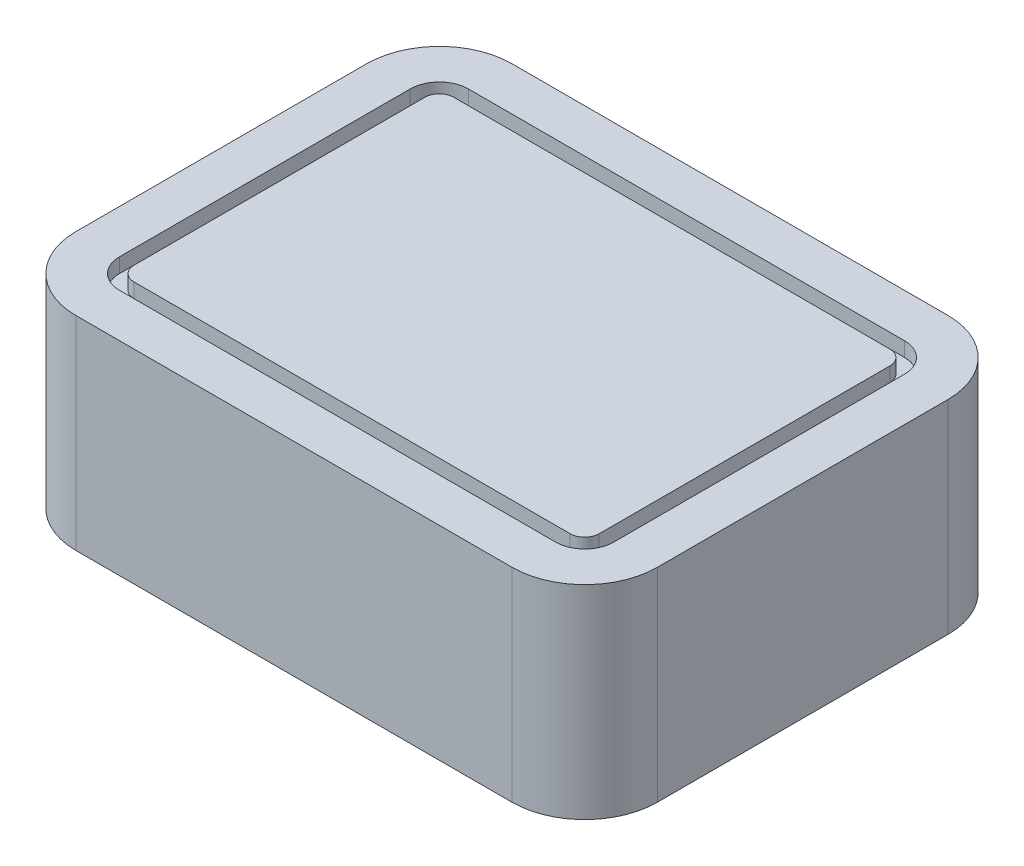
ISO-10303-21;
HEADER;
FILE_DESCRIPTION(('STEP AP214'),'2;1');
FILE_NAME('part.step','',(''),(''),'','','');
FILE_SCHEMA(('AUTOMOTIVE_DESIGN { 1 0 10303 214 1 1 1 1 }'));
ENDSEC;
DATA;
#1=APPLICATION_CONTEXT('core data for automotive mechanical design processes');
#2=APPLICATION_PROTOCOL_DEFINITION('international standard','automotive_design',2000,#1);
#3=PRODUCT_CONTEXT('',#1,'mechanical');
#4=PRODUCT('Part','Part','',(#3));
#5=PRODUCT_RELATED_PRODUCT_CATEGORY('part','',(#4));
#6=PRODUCT_DEFINITION_FORMATION('','',#4);
#7=PRODUCT_DEFINITION_CONTEXT('part definition',#1,'design');
#8=PRODUCT_DEFINITION('design','',#6,#7);
#9=PRODUCT_DEFINITION_SHAPE('','',#8);
#10=(LENGTH_UNIT() NAMED_UNIT(*) SI_UNIT(.MILLI.,.METRE.));
#11=(NAMED_UNIT(*) PLANE_ANGLE_UNIT() SI_UNIT($,.RADIAN.));
#12=(NAMED_UNIT(*) SI_UNIT($,.STERADIAN.) SOLID_ANGLE_UNIT());
#13=UNCERTAINTY_MEASURE_WITH_UNIT(LENGTH_MEASURE(1.E-05),#10,'distance_accuracy_value','');
#14=(GEOMETRIC_REPRESENTATION_CONTEXT(3) GLOBAL_UNCERTAINTY_ASSIGNED_CONTEXT((#13)) GLOBAL_UNIT_ASSIGNED_CONTEXT((#10,
#11,#12)) REPRESENTATION_CONTEXT('',''));
#15=CARTESIAN_POINT('',(0.,0.,0.));
#16=DIRECTION('',(0.,0.,1.));
#17=DIRECTION('',(1.,0.,0.));
#18=AXIS2_PLACEMENT_3D('',#15,#16,#17);
#19=CARTESIAN_POINT('',(20.,14.,-15.));
#20=DIRECTION('',(-1.,0.,0.));
#21=DIRECTION('',(0.,0.,1.));
#22=AXIS2_PLACEMENT_3D('',#19,#20,#21);
#23=PLANE('',#22);
#24=DIRECTION('',(0.,0.,-1.));
#25=VECTOR('',#24,1.);
#26=CARTESIAN_POINT('',(20.,0.,-15.));
#27=LINE('',#26,#25);
#28=CARTESIAN_POINT('',(20.,0.,9.99999999999999));
#29=VERTEX_POINT('',#28);
#30=CARTESIAN_POINT('',(20.,0.,-10.));
#31=VERTEX_POINT('',#30);
#32=EDGE_CURVE('E315',#29,#31,#27,.T.);
#33=ORIENTED_EDGE('',*,*,#32,.T.);
#34=DIRECTION('',(0.,-1.,0.));
#35=VECTOR('',#34,1.);
#36=CARTESIAN_POINT('',(20.,14.,-10.));
#37=LINE('',#36,#35);
#38=CARTESIAN_POINT('',(20.,14.,-10.));
#39=VERTEX_POINT('',#38);
#40=EDGE_CURVE('E11',#31,#39,#37,.F.);
#41=ORIENTED_EDGE('',*,*,#40,.T.);
#42=DIRECTION('',(0.,0.,-1.));
#43=VECTOR('',#42,1.);
#44=CARTESIAN_POINT('',(20.,14.,-15.));
#45=LINE('',#44,#43);
#46=CARTESIAN_POINT('',(20.,14.,9.99999999999999));
#47=VERTEX_POINT('',#46);
#48=EDGE_CURVE('E329',#47,#39,#45,.T.);
#49=ORIENTED_EDGE('',*,*,#48,.F.);
#50=DIRECTION('',(0.,-1.,0.));
#51=VECTOR('',#50,1.);
#52=CARTESIAN_POINT('',(20.,14.,9.99999999999999));
#53=LINE('',#52,#51);
#54=EDGE_CURVE('E40',#47,#29,#53,.T.);
#55=ORIENTED_EDGE('',*,*,#54,.T.);
#56=EDGE_LOOP('',(#33,#41,#49,#55));
#57=FACE_BOUND('',#56,.T.);
#58=ADVANCED_FACE('F32',(#57),#23,.F.);
#59=CARTESIAN_POINT('',(-20.,14.,-15.));
#60=DIRECTION('',(0.,0.,1.));
#61=DIRECTION('',(1.,0.,0.));
#62=AXIS2_PLACEMENT_3D('',#59,#60,#61);
#63=PLANE('',#62);
#64=DIRECTION('',(-1.,0.,0.));
#65=VECTOR('',#64,1.);
#66=CARTESIAN_POINT('',(-20.,0.,-15.));
#67=LINE('',#66,#65);
#68=CARTESIAN_POINT('',(15.,0.,-15.));
#69=VERTEX_POINT('',#68);
#70=CARTESIAN_POINT('',(-15.,0.,-15.));
#71=VERTEX_POINT('',#70);
#72=EDGE_CURVE('E345',#69,#71,#67,.T.);
#73=ORIENTED_EDGE('',*,*,#72,.T.);
#74=DIRECTION('',(0.,-1.,0.));
#75=VECTOR('',#74,1.);
#76=CARTESIAN_POINT('',(-15.,14.,-15.));
#77=LINE('',#76,#75);
#78=CARTESIAN_POINT('',(-15.,14.,-15.));
#79=VERTEX_POINT('',#78);
#80=EDGE_CURVE('E368',#71,#79,#77,.F.);
#81=ORIENTED_EDGE('',*,*,#80,.T.);
#82=DIRECTION('',(-1.,0.,0.));
#83=VECTOR('',#82,1.);
#84=CARTESIAN_POINT('',(-20.,14.,-15.));
#85=LINE('',#84,#83);
#86=CARTESIAN_POINT('',(15.,14.,-15.));
#87=VERTEX_POINT('',#86);
#88=EDGE_CURVE('E332',#87,#79,#85,.T.);
#89=ORIENTED_EDGE('',*,*,#88,.F.);
#90=DIRECTION('',(0.,-1.,0.));
#91=VECTOR('',#90,1.);
#92=CARTESIAN_POINT('',(15.,14.,-15.));
#93=LINE('',#92,#91);
#94=EDGE_CURVE('E365',#87,#69,#93,.T.);
#95=ORIENTED_EDGE('',*,*,#94,.T.);
#96=EDGE_LOOP('',(#73,#81,#89,#95));
#97=FACE_BOUND('',#96,.T.);
#98=ADVANCED_FACE('F401',(#97),#63,.F.);
#99=CARTESIAN_POINT('',(-20.,14.,-15.));
#100=DIRECTION('',(1.,0.,0.));
#101=DIRECTION('',(0.,0.,-1.));
#102=AXIS2_PLACEMENT_3D('',#99,#100,#101);
#103=PLANE('',#102);
#104=DIRECTION('',(0.,0.,1.));
#105=VECTOR('',#104,1.);
#106=CARTESIAN_POINT('',(-20.,14.,-15.));
#107=LINE('',#106,#105);
#108=CARTESIAN_POINT('',(-20.,14.,-10.));
#109=VERTEX_POINT('',#108);
#110=CARTESIAN_POINT('',(-20.,14.,10.));
#111=VERTEX_POINT('',#110);
#112=EDGE_CURVE('E336',#109,#111,#107,.T.);
#113=ORIENTED_EDGE('',*,*,#112,.F.);
#114=DIRECTION('',(0.,-1.,0.));
#115=VECTOR('',#114,1.);
#116=CARTESIAN_POINT('',(-20.,14.,-10.));
#117=LINE('',#116,#115);
#118=CARTESIAN_POINT('',(-20.,0.,-10.));
#119=VERTEX_POINT('',#118);
#120=EDGE_CURVE('E354',#109,#119,#117,.T.);
#121=ORIENTED_EDGE('',*,*,#120,.T.);
#122=DIRECTION('',(0.,0.,1.));
#123=VECTOR('',#122,1.);
#124=CARTESIAN_POINT('',(-20.,0.,-15.));
#125=LINE('',#124,#123);
#126=CARTESIAN_POINT('',(-20.,0.,10.));
#127=VERTEX_POINT('',#126);
#128=EDGE_CURVE('E348',#119,#127,#125,.T.);
#129=ORIENTED_EDGE('',*,*,#128,.T.);
#130=DIRECTION('',(0.,-1.,0.));
#131=VECTOR('',#130,1.);
#132=CARTESIAN_POINT('',(-20.,14.,10.));
#133=LINE('',#132,#131);
#134=EDGE_CURVE('E342',#127,#111,#133,.F.);
#135=ORIENTED_EDGE('',*,*,#134,.T.);
#136=EDGE_LOOP('',(#113,#121,#129,#135));
#137=FACE_BOUND('',#136,.T.);
#138=ADVANCED_FACE('F411',(#137),#103,.F.);
#139=CARTESIAN_POINT('',(-20.,14.,15.));
#140=DIRECTION('',(0.,0.,-1.));
#141=DIRECTION('',(-1.,0.,0.));
#142=AXIS2_PLACEMENT_3D('',#139,#140,#141);
#143=PLANE('',#142);
#144=DIRECTION('',(1.,0.,0.));
#145=VECTOR('',#144,1.);
#146=CARTESIAN_POINT('',(-20.,14.,15.));
#147=LINE('',#146,#145);
#148=CARTESIAN_POINT('',(-15.,14.,15.));
#149=VERTEX_POINT('',#148);
#150=CARTESIAN_POINT('',(15.,14.,15.));
#151=VERTEX_POINT('',#150);
#152=EDGE_CURVE('E339',#149,#151,#147,.T.);
#153=ORIENTED_EDGE('',*,*,#152,.F.);
#154=DIRECTION('',(0.,-1.,0.));
#155=VECTOR('',#154,1.);
#156=CARTESIAN_POINT('',(-15.,14.,15.));
#157=LINE('',#156,#155);
#158=CARTESIAN_POINT('',(-15.,0.,15.));
#159=VERTEX_POINT('',#158);
#160=EDGE_CURVE('E380',#149,#159,#157,.T.);
#161=ORIENTED_EDGE('',*,*,#160,.T.);
#162=DIRECTION('',(1.,0.,0.));
#163=VECTOR('',#162,1.);
#164=CARTESIAN_POINT('',(-20.,0.,15.));
#165=LINE('',#164,#163);
#166=CARTESIAN_POINT('',(15.,0.,15.));
#167=VERTEX_POINT('',#166);
#168=EDGE_CURVE('E333',#159,#167,#165,.T.);
#169=ORIENTED_EDGE('',*,*,#168,.T.);
#170=DIRECTION('',(0.,-1.,0.));
#171=VECTOR('',#170,1.);
#172=CARTESIAN_POINT('',(15.,14.,15.));
#173=LINE('',#172,#171);
#174=EDGE_CURVE('E378',#167,#151,#173,.F.);
#175=ORIENTED_EDGE('',*,*,#174,.T.);
#176=EDGE_LOOP('',(#153,#161,#169,#175));
#177=FACE_BOUND('',#176,.T.);
#178=ADVANCED_FACE('F419',(#177),#143,.F.);
#179=CARTESIAN_POINT('',(0.,14.,0.));
#180=DIRECTION('',(0.,1.,0.));
#181=DIRECTION('',(0.,0.,1.));
#182=AXIS2_PLACEMENT_3D('',#179,#180,#181);
#183=PLANE('',#182);
#184=CARTESIAN_POINT('',(15.,14.,-10.));
#185=DIRECTION('',(0.,1.,0.));
#186=DIRECTION('',(0.,0.,1.));
#187=AXIS2_PLACEMENT_3D('',#184,#185,#186);
#188=CIRCLE('',#187,2.);
#189=CARTESIAN_POINT('',(17.,14.,-10.));
#190=VERTEX_POINT('',#189);
#191=CARTESIAN_POINT('',(15.,14.,-12.));
#192=VERTEX_POINT('',#191);
#193=EDGE_CURVE('E47',#190,#192,#188,.T.);
#194=ORIENTED_EDGE('',*,*,#193,.F.);
#195=DIRECTION('',(0.,0.,-1.));
#196=VECTOR('',#195,1.);
#197=CARTESIAN_POINT('',(17.,14.,9.99999999999999));
#198=LINE('',#197,#196);
#199=CARTESIAN_POINT('',(17.,14.,9.99999999999999));
#200=VERTEX_POINT('',#199);
#201=EDGE_CURVE('E270',#200,#190,#198,.T.);
#202=ORIENTED_EDGE('',*,*,#201,.F.);
#203=CARTESIAN_POINT('',(15.,14.,9.99999999999999));
#204=DIRECTION('',(0.,1.,0.));
#205=DIRECTION('',(0.,0.,1.));
#206=AXIS2_PLACEMENT_3D('',#203,#204,#205);
#207=CIRCLE('',#206,2.);
#208=CARTESIAN_POINT('',(15.,14.,12.));
#209=VERTEX_POINT('',#208);
#210=EDGE_CURVE('E308',#209,#200,#207,.T.);
#211=ORIENTED_EDGE('',*,*,#210,.F.);
#212=DIRECTION('',(1.,0.,0.));
#213=VECTOR('',#212,1.);
#214=CARTESIAN_POINT('',(-15.,14.,12.));
#215=LINE('',#214,#213);
#216=CARTESIAN_POINT('',(-15.,14.,12.));
#217=VERTEX_POINT('',#216);
#218=EDGE_CURVE('E305',#217,#209,#215,.T.);
#219=ORIENTED_EDGE('',*,*,#218,.F.);
#220=CARTESIAN_POINT('',(-15.,14.,9.99999999999999));
#221=DIRECTION('',(0.,1.,0.));
#222=DIRECTION('',(0.,0.,1.));
#223=AXIS2_PLACEMENT_3D('',#220,#221,#222);
#224=CIRCLE('',#223,2.);
#225=CARTESIAN_POINT('',(-17.,14.,10.));
#226=VERTEX_POINT('',#225);
#227=EDGE_CURVE('E302',#226,#217,#224,.T.);
#228=ORIENTED_EDGE('',*,*,#227,.F.);
#229=DIRECTION('',(0.,0.,1.));
#230=VECTOR('',#229,1.);
#231=CARTESIAN_POINT('',(-17.,14.,-10.));
#232=LINE('',#231,#230);
#233=CARTESIAN_POINT('',(-17.,14.,-10.));
#234=VERTEX_POINT('',#233);
#235=EDGE_CURVE('E299',#234,#226,#232,.T.);
#236=ORIENTED_EDGE('',*,*,#235,.F.);
#237=CARTESIAN_POINT('',(-15.,14.,-10.));
#238=DIRECTION('',(0.,1.,0.));
#239=DIRECTION('',(0.,0.,1.));
#240=AXIS2_PLACEMENT_3D('',#237,#238,#239);
#241=CIRCLE('',#240,2.);
#242=CARTESIAN_POINT('',(-15.,14.,-12.));
#243=VERTEX_POINT('',#242);
#244=EDGE_CURVE('E296',#243,#234,#241,.T.);
#245=ORIENTED_EDGE('',*,*,#244,.F.);
#246=DIRECTION('',(-1.,0.,0.));
#247=VECTOR('',#246,1.);
#248=CARTESIAN_POINT('',(15.,14.,-12.));
#249=LINE('',#248,#247);
#250=EDGE_CURVE('E293',#192,#243,#249,.T.);
#251=ORIENTED_EDGE('',*,*,#250,.F.);
#252=EDGE_LOOP('',(#194,#202,#211,#219,#228,#236,#245,#251));
#253=FACE_BOUND('',#252,.T.);
#254=ORIENTED_EDGE('',*,*,#88,.T.);
#255=CARTESIAN_POINT('',(-15.,14.,-10.));
#256=DIRECTION('',(0.,1.,0.));
#257=DIRECTION('',(0.,0.,1.));
#258=AXIS2_PLACEMENT_3D('',#255,#256,#257);
#259=CIRCLE('',#258,5.);
#260=EDGE_CURVE('E376',#79,#109,#259,.T.);
#261=ORIENTED_EDGE('',*,*,#260,.T.);
#262=ORIENTED_EDGE('',*,*,#112,.T.);
#263=CARTESIAN_POINT('',(-15.,14.,9.99999999999999));
#264=DIRECTION('',(0.,1.,0.));
#265=DIRECTION('',(0.,0.,1.));
#266=AXIS2_PLACEMENT_3D('',#263,#264,#265);
#267=CIRCLE('',#266,5.);
#268=EDGE_CURVE('E374',#111,#149,#267,.T.);
#269=ORIENTED_EDGE('',*,*,#268,.T.);
#270=ORIENTED_EDGE('',*,*,#152,.T.);
#271=CARTESIAN_POINT('',(15.,14.,9.99999999999999));
#272=DIRECTION('',(0.,1.,0.));
#273=DIRECTION('',(0.,0.,1.));
#274=AXIS2_PLACEMENT_3D('',#271,#272,#273);
#275=CIRCLE('',#274,5.);
#276=EDGE_CURVE('E370',#151,#47,#275,.T.);
#277=ORIENTED_EDGE('',*,*,#276,.T.);
#278=ORIENTED_EDGE('',*,*,#48,.T.);
#279=CARTESIAN_POINT('',(15.,14.,-10.));
#280=DIRECTION('',(0.,1.,0.));
#281=DIRECTION('',(0.,0.,1.));
#282=AXIS2_PLACEMENT_3D('',#279,#280,#281);
#283=CIRCLE('',#282,5.);
#284=EDGE_CURVE('E372',#39,#87,#283,.T.);
#285=ORIENTED_EDGE('',*,*,#284,.T.);
#286=EDGE_LOOP('',(#254,#261,#262,#269,#270,#277,#278,#285));
#287=FACE_BOUND('',#286,.T.);
#288=ADVANCED_FACE('F405',(#253,#287),#183,.T.);
#289=CARTESIAN_POINT('',(0.,0.,0.));
#290=DIRECTION('',(0.,1.,0.));
#291=DIRECTION('',(0.,0.,1.));
#292=AXIS2_PLACEMENT_3D('',#289,#290,#291);
#293=PLANE('',#292);
#294=ORIENTED_EDGE('',*,*,#128,.F.);
#295=CARTESIAN_POINT('',(-15.,0.,-10.));
#296=DIRECTION('',(0.,1.,0.));
#297=DIRECTION('',(0.,0.,1.));
#298=AXIS2_PLACEMENT_3D('',#295,#296,#297);
#299=CIRCLE('',#298,5.);
#300=EDGE_CURVE('E363',#119,#71,#299,.F.);
#301=ORIENTED_EDGE('',*,*,#300,.T.);
#302=ORIENTED_EDGE('',*,*,#72,.F.);
#303=CARTESIAN_POINT('',(15.,0.,-10.));
#304=DIRECTION('',(0.,1.,0.));
#305=DIRECTION('',(0.,0.,1.));
#306=AXIS2_PLACEMENT_3D('',#303,#304,#305);
#307=CIRCLE('',#306,5.);
#308=EDGE_CURVE('E359',#69,#31,#307,.F.);
#309=ORIENTED_EDGE('',*,*,#308,.T.);
#310=ORIENTED_EDGE('',*,*,#32,.F.);
#311=CARTESIAN_POINT('',(15.,0.,9.99999999999999));
#312=DIRECTION('',(0.,1.,0.));
#313=DIRECTION('',(0.,0.,1.));
#314=AXIS2_PLACEMENT_3D('',#311,#312,#313);
#315=CIRCLE('',#314,5.);
#316=EDGE_CURVE('E357',#29,#167,#315,.F.);
#317=ORIENTED_EDGE('',*,*,#316,.T.);
#318=ORIENTED_EDGE('',*,*,#168,.F.);
#319=CARTESIAN_POINT('',(-15.,0.,9.99999999999999));
#320=DIRECTION('',(0.,1.,0.));
#321=DIRECTION('',(0.,0.,1.));
#322=AXIS2_PLACEMENT_3D('',#319,#320,#321);
#323=CIRCLE('',#322,5.);
#324=EDGE_CURVE('E361',#159,#127,#323,.F.);
#325=ORIENTED_EDGE('',*,*,#324,.T.);
#326=EDGE_LOOP('',(#294,#301,#302,#309,#310,#317,#318,#325));
#327=FACE_BOUND('',#326,.T.);
#328=ADVANCED_FACE('F392',(#327),#293,.F.);
#329=CARTESIAN_POINT('',(-15.,14.,-10.));
#330=DIRECTION('',(0.,-1.,0.));
#331=DIRECTION('',(0.,0.,-1.));
#332=AXIS2_PLACEMENT_3D('',#329,#330,#331);
#333=CYLINDRICAL_SURFACE('',#332,5.);
#334=ORIENTED_EDGE('',*,*,#260,.F.);
#335=ORIENTED_EDGE('',*,*,#80,.F.);
#336=ORIENTED_EDGE('',*,*,#300,.F.);
#337=ORIENTED_EDGE('',*,*,#120,.F.);
#338=EDGE_LOOP('',(#334,#335,#336,#337));
#339=FACE_BOUND('',#338,.T.);
#340=ADVANCED_FACE('F409',(#339),#333,.T.);
#341=CARTESIAN_POINT('',(-15.,14.,9.99999999999999));
#342=DIRECTION('',(0.,-1.,0.));
#343=DIRECTION('',(0.,0.,-1.));
#344=AXIS2_PLACEMENT_3D('',#341,#342,#343);
#345=CYLINDRICAL_SURFACE('',#344,5.);
#346=ORIENTED_EDGE('',*,*,#268,.F.);
#347=ORIENTED_EDGE('',*,*,#134,.F.);
#348=ORIENTED_EDGE('',*,*,#324,.F.);
#349=ORIENTED_EDGE('',*,*,#160,.F.);
#350=EDGE_LOOP('',(#346,#347,#348,#349));
#351=FACE_BOUND('',#350,.T.);
#352=ADVANCED_FACE('F416',(#351),#345,.T.);
#353=CARTESIAN_POINT('',(15.,14.,-10.));
#354=DIRECTION('',(0.,-1.,0.));
#355=DIRECTION('',(0.,0.,-1.));
#356=AXIS2_PLACEMENT_3D('',#353,#354,#355);
#357=CYLINDRICAL_SURFACE('',#356,5.);
#358=ORIENTED_EDGE('',*,*,#284,.F.);
#359=ORIENTED_EDGE('',*,*,#40,.F.);
#360=ORIENTED_EDGE('',*,*,#308,.F.);
#361=ORIENTED_EDGE('',*,*,#94,.F.);
#362=EDGE_LOOP('',(#358,#359,#360,#361));
#363=FACE_BOUND('',#362,.T.);
#364=ADVANCED_FACE('F398',(#363),#357,.T.);
#365=CARTESIAN_POINT('',(15.,14.,9.99999999999999));
#366=DIRECTION('',(0.,-1.,0.));
#367=DIRECTION('',(0.,0.,-1.));
#368=AXIS2_PLACEMENT_3D('',#365,#366,#367);
#369=CYLINDRICAL_SURFACE('',#368,5.);
#370=ORIENTED_EDGE('',*,*,#276,.F.);
#371=ORIENTED_EDGE('',*,*,#174,.F.);
#372=ORIENTED_EDGE('',*,*,#316,.F.);
#373=ORIENTED_EDGE('',*,*,#54,.F.);
#374=EDGE_LOOP('',(#370,#371,#372,#373));
#375=FACE_BOUND('',#374,.T.);
#376=ADVANCED_FACE('F34',(#375),#369,.T.);
#377=CARTESIAN_POINT('',(15.,13.,-10.));
#378=DIRECTION('',(0.,1.,0.));
#379=DIRECTION('',(0.,0.,1.));
#380=AXIS2_PLACEMENT_3D('',#377,#378,#379);
#381=CYLINDRICAL_SURFACE('',#380,2.);
#382=ORIENTED_EDGE('',*,*,#193,.T.);
#383=DIRECTION('',(0.,1.,0.));
#384=VECTOR('',#383,1.);
#385=CARTESIAN_POINT('',(15.,13.,-12.));
#386=LINE('',#385,#384);
#387=CARTESIAN_POINT('',(15.,13.,-12.));
#388=VERTEX_POINT('',#387);
#389=EDGE_CURVE('E291',#388,#192,#386,.T.);
#390=ORIENTED_EDGE('',*,*,#389,.F.);
#391=CARTESIAN_POINT('',(15.,13.,-10.));
#392=DIRECTION('',(0.,1.,0.));
#393=DIRECTION('',(0.,0.,1.));
#394=AXIS2_PLACEMENT_3D('',#391,#392,#393);
#395=CIRCLE('',#394,2.);
#396=CARTESIAN_POINT('',(17.,13.,-10.));
#397=VERTEX_POINT('',#396);
#398=EDGE_CURVE('E266',#397,#388,#395,.T.);
#399=ORIENTED_EDGE('',*,*,#398,.F.);
#400=DIRECTION('',(0.,1.,0.));
#401=VECTOR('',#400,1.);
#402=CARTESIAN_POINT('',(17.,13.,-10.));
#403=LINE('',#402,#401);
#404=EDGE_CURVE('E313',#397,#190,#403,.T.);
#405=ORIENTED_EDGE('',*,*,#404,.T.);
#406=EDGE_LOOP('',(#382,#390,#399,#405));
#407=FACE_BOUND('',#406,.T.);
#408=ADVANCED_FACE('F422',(#407),#381,.F.);
#409=CARTESIAN_POINT('',(17.,13.,9.99999999999999));
#410=DIRECTION('',(1.,0.,0.));
#411=DIRECTION('',(0.,0.,-1.));
#412=AXIS2_PLACEMENT_3D('',#409,#410,#411);
#413=PLANE('',#412);
#414=ORIENTED_EDGE('',*,*,#201,.T.);
#415=ORIENTED_EDGE('',*,*,#404,.F.);
#416=DIRECTION('',(0.,0.,-1.));
#417=VECTOR('',#416,1.);
#418=CARTESIAN_POINT('',(17.,13.,9.99999999999999));
#419=LINE('',#418,#417);
#420=CARTESIAN_POINT('',(17.,13.,9.99999999999999));
#421=VERTEX_POINT('',#420);
#422=EDGE_CURVE('E288',#421,#397,#419,.T.);
#423=ORIENTED_EDGE('',*,*,#422,.F.);
#424=DIRECTION('',(0.,1.,0.));
#425=VECTOR('',#424,1.);
#426=CARTESIAN_POINT('',(17.,13.,9.99999999999999));
#427=LINE('',#426,#425);
#428=EDGE_CURVE('E316',#421,#200,#427,.T.);
#429=ORIENTED_EDGE('',*,*,#428,.T.);
#430=EDGE_LOOP('',(#414,#415,#423,#429));
#431=FACE_BOUND('',#430,.T.);
#432=ADVANCED_FACE('F427',(#431),#413,.F.);
#433=CARTESIAN_POINT('',(15.,13.,9.99999999999999));
#434=DIRECTION('',(0.,1.,0.));
#435=DIRECTION('',(0.,0.,1.));
#436=AXIS2_PLACEMENT_3D('',#433,#434,#435);
#437=CYLINDRICAL_SURFACE('',#436,2.);
#438=ORIENTED_EDGE('',*,*,#210,.T.);
#439=ORIENTED_EDGE('',*,*,#428,.F.);
#440=CARTESIAN_POINT('',(15.,13.,9.99999999999999));
#441=DIRECTION('',(0.,1.,0.));
#442=DIRECTION('',(0.,0.,1.));
#443=AXIS2_PLACEMENT_3D('',#440,#441,#442);
#444=CIRCLE('',#443,2.);
#445=CARTESIAN_POINT('',(15.,13.,12.));
#446=VERTEX_POINT('',#445);
#447=EDGE_CURVE('E285',#446,#421,#444,.T.);
#448=ORIENTED_EDGE('',*,*,#447,.F.);
#449=DIRECTION('',(0.,1.,0.));
#450=VECTOR('',#449,1.);
#451=CARTESIAN_POINT('',(15.,13.,12.));
#452=LINE('',#451,#450);
#453=EDGE_CURVE('E318',#446,#209,#452,.T.);
#454=ORIENTED_EDGE('',*,*,#453,.T.);
#455=EDGE_LOOP('',(#438,#439,#448,#454));
#456=FACE_BOUND('',#455,.T.);
#457=ADVANCED_FACE('F482',(#456),#437,.F.);
#458=CARTESIAN_POINT('',(-15.,13.,12.));
#459=DIRECTION('',(0.,0.,1.));
#460=DIRECTION('',(1.,0.,0.));
#461=AXIS2_PLACEMENT_3D('',#458,#459,#460);
#462=PLANE('',#461);
#463=ORIENTED_EDGE('',*,*,#218,.T.);
#464=ORIENTED_EDGE('',*,*,#453,.F.);
#465=DIRECTION('',(1.,0.,0.));
#466=VECTOR('',#465,1.);
#467=CARTESIAN_POINT('',(-15.,13.,12.));
#468=LINE('',#467,#466);
#469=CARTESIAN_POINT('',(-15.,13.,12.));
#470=VERTEX_POINT('',#469);
#471=EDGE_CURVE('E282',#470,#446,#468,.T.);
#472=ORIENTED_EDGE('',*,*,#471,.F.);
#473=DIRECTION('',(0.,1.,0.));
#474=VECTOR('',#473,1.);
#475=CARTESIAN_POINT('',(-15.,13.,12.));
#476=LINE('',#475,#474);
#477=EDGE_CURVE('E320',#470,#217,#476,.T.);
#478=ORIENTED_EDGE('',*,*,#477,.T.);
#479=EDGE_LOOP('',(#463,#464,#472,#478));
#480=FACE_BOUND('',#479,.T.);
#481=ADVANCED_FACE('F492',(#480),#462,.F.);
#482=CARTESIAN_POINT('',(-15.,13.,9.99999999999999));
#483=DIRECTION('',(0.,1.,0.));
#484=DIRECTION('',(0.,0.,1.));
#485=AXIS2_PLACEMENT_3D('',#482,#483,#484);
#486=CYLINDRICAL_SURFACE('',#485,2.);
#487=ORIENTED_EDGE('',*,*,#227,.T.);
#488=ORIENTED_EDGE('',*,*,#477,.F.);
#489=CARTESIAN_POINT('',(-15.,13.,9.99999999999999));
#490=DIRECTION('',(0.,1.,0.));
#491=DIRECTION('',(0.,0.,1.));
#492=AXIS2_PLACEMENT_3D('',#489,#490,#491);
#493=CIRCLE('',#492,2.);
#494=CARTESIAN_POINT('',(-17.,13.,10.));
#495=VERTEX_POINT('',#494);
#496=EDGE_CURVE('E279',#495,#470,#493,.T.);
#497=ORIENTED_EDGE('',*,*,#496,.F.);
#498=DIRECTION('',(0.,1.,0.));
#499=VECTOR('',#498,1.);
#500=CARTESIAN_POINT('',(-17.,13.,10.));
#501=LINE('',#500,#499);
#502=EDGE_CURVE('E322',#495,#226,#501,.T.);
#503=ORIENTED_EDGE('',*,*,#502,.T.);
#504=EDGE_LOOP('',(#487,#488,#497,#503));
#505=FACE_BOUND('',#504,.T.);
#506=ADVANCED_FACE('F502',(#505),#486,.F.);
#507=CARTESIAN_POINT('',(-17.,13.,-10.));
#508=DIRECTION('',(-1.,0.,0.));
#509=DIRECTION('',(0.,0.,1.));
#510=AXIS2_PLACEMENT_3D('',#507,#508,#509);
#511=PLANE('',#510);
#512=ORIENTED_EDGE('',*,*,#235,.T.);
#513=ORIENTED_EDGE('',*,*,#502,.F.);
#514=DIRECTION('',(0.,0.,1.));
#515=VECTOR('',#514,1.);
#516=CARTESIAN_POINT('',(-17.,13.,-10.));
#517=LINE('',#516,#515);
#518=CARTESIAN_POINT('',(-17.,13.,-10.));
#519=VERTEX_POINT('',#518);
#520=EDGE_CURVE('E276',#519,#495,#517,.T.);
#521=ORIENTED_EDGE('',*,*,#520,.F.);
#522=DIRECTION('',(0.,1.,0.));
#523=VECTOR('',#522,1.);
#524=CARTESIAN_POINT('',(-17.,13.,-10.));
#525=LINE('',#524,#523);
#526=EDGE_CURVE('E324',#519,#234,#525,.T.);
#527=ORIENTED_EDGE('',*,*,#526,.T.);
#528=EDGE_LOOP('',(#512,#513,#521,#527));
#529=FACE_BOUND('',#528,.T.);
#530=ADVANCED_FACE('F512',(#529),#511,.F.);
#531=CARTESIAN_POINT('',(-15.,13.,-10.));
#532=DIRECTION('',(0.,1.,0.));
#533=DIRECTION('',(0.,0.,1.));
#534=AXIS2_PLACEMENT_3D('',#531,#532,#533);
#535=CYLINDRICAL_SURFACE('',#534,2.);
#536=ORIENTED_EDGE('',*,*,#244,.T.);
#537=ORIENTED_EDGE('',*,*,#526,.F.);
#538=CARTESIAN_POINT('',(-15.,13.,-10.));
#539=DIRECTION('',(0.,1.,0.));
#540=DIRECTION('',(0.,0.,1.));
#541=AXIS2_PLACEMENT_3D('',#538,#539,#540);
#542=CIRCLE('',#541,2.);
#543=CARTESIAN_POINT('',(-15.,13.,-12.));
#544=VERTEX_POINT('',#543);
#545=EDGE_CURVE('E273',#544,#519,#542,.T.);
#546=ORIENTED_EDGE('',*,*,#545,.F.);
#547=DIRECTION('',(0.,1.,0.));
#548=VECTOR('',#547,1.);
#549=CARTESIAN_POINT('',(-15.,13.,-12.));
#550=LINE('',#549,#548);
#551=EDGE_CURVE('E326',#544,#243,#550,.T.);
#552=ORIENTED_EDGE('',*,*,#551,.T.);
#553=EDGE_LOOP('',(#536,#537,#546,#552));
#554=FACE_BOUND('',#553,.T.);
#555=ADVANCED_FACE('F522',(#554),#535,.F.);
#556=CARTESIAN_POINT('',(15.,13.,-12.));
#557=DIRECTION('',(0.,0.,-1.));
#558=DIRECTION('',(-1.,0.,0.));
#559=AXIS2_PLACEMENT_3D('',#556,#557,#558);
#560=PLANE('',#559);
#561=ORIENTED_EDGE('',*,*,#250,.T.);
#562=ORIENTED_EDGE('',*,*,#551,.F.);
#563=DIRECTION('',(-1.,0.,0.));
#564=VECTOR('',#563,1.);
#565=CARTESIAN_POINT('',(15.,13.,-12.));
#566=LINE('',#565,#564);
#567=EDGE_CURVE('E269',#388,#544,#566,.T.);
#568=ORIENTED_EDGE('',*,*,#567,.F.);
#569=ORIENTED_EDGE('',*,*,#389,.T.);
#570=EDGE_LOOP('',(#561,#562,#568,#569));
#571=FACE_BOUND('',#570,.T.);
#572=ADVANCED_FACE('F532',(#571),#560,.F.);
#573=CARTESIAN_POINT('',(15.,13.,-10.));
#574=DIRECTION('',(0.,1.,0.));
#575=DIRECTION('',(0.,0.,1.));
#576=AXIS2_PLACEMENT_3D('',#573,#574,#575);
#577=PLANE('',#576);
#578=DIRECTION('',(-1.,0.,0.));
#579=VECTOR('',#578,1.);
#580=CARTESIAN_POINT('',(15.,13.,-11.));
#581=LINE('',#580,#579);
#582=CARTESIAN_POINT('',(15.,13.,-11.));
#583=VERTEX_POINT('',#582);
#584=CARTESIAN_POINT('',(-15.,13.,-11.));
#585=VERTEX_POINT('',#584);
#586=EDGE_CURVE('E204',#583,#585,#581,.T.);
#587=ORIENTED_EDGE('',*,*,#586,.F.);
#588=CARTESIAN_POINT('',(15.,13.,-10.));
#589=DIRECTION('',(0.,1.,0.));
#590=DIRECTION('',(0.,0.,1.));
#591=AXIS2_PLACEMENT_3D('',#588,#589,#590);
#592=CIRCLE('',#591,1.);
#593=CARTESIAN_POINT('',(16.,13.,-10.));
#594=VERTEX_POINT('',#593);
#595=EDGE_CURVE('E235',#594,#583,#592,.T.);
#596=ORIENTED_EDGE('',*,*,#595,.F.);
#597=DIRECTION('',(0.,0.,-1.));
#598=VECTOR('',#597,1.);
#599=CARTESIAN_POINT('',(16.,13.,9.99999999999999));
#600=LINE('',#599,#598);
#601=CARTESIAN_POINT('',(16.,13.,9.99999999999999));
#602=VERTEX_POINT('',#601);
#603=EDGE_CURVE('E232',#602,#594,#600,.T.);
#604=ORIENTED_EDGE('',*,*,#603,.F.);
#605=CARTESIAN_POINT('',(15.,13.,9.99999999999999));
#606=DIRECTION('',(0.,1.,0.));
#607=DIRECTION('',(0.,0.,1.));
#608=AXIS2_PLACEMENT_3D('',#605,#606,#607);
#609=CIRCLE('',#608,1.);
#610=CARTESIAN_POINT('',(15.,13.,11.));
#611=VERTEX_POINT('',#610);
#612=EDGE_CURVE('E229',#611,#602,#609,.T.);
#613=ORIENTED_EDGE('',*,*,#612,.F.);
#614=DIRECTION('',(1.,0.,0.));
#615=VECTOR('',#614,1.);
#616=CARTESIAN_POINT('',(-15.,13.,11.));
#617=LINE('',#616,#615);
#618=CARTESIAN_POINT('',(-15.,13.,11.));
#619=VERTEX_POINT('',#618);
#620=EDGE_CURVE('E226',#619,#611,#617,.T.);
#621=ORIENTED_EDGE('',*,*,#620,.F.);
#622=CARTESIAN_POINT('',(-15.,13.,9.99999999999999));
#623=DIRECTION('',(0.,1.,0.));
#624=DIRECTION('',(0.,0.,1.));
#625=AXIS2_PLACEMENT_3D('',#622,#623,#624);
#626=CIRCLE('',#625,1.);
#627=CARTESIAN_POINT('',(-16.,13.,9.99999999999999));
#628=VERTEX_POINT('',#627);
#629=EDGE_CURVE('E215',#628,#619,#626,.T.);
#630=ORIENTED_EDGE('',*,*,#629,.F.);
#631=DIRECTION('',(0.,0.,1.));
#632=VECTOR('',#631,1.);
#633=CARTESIAN_POINT('',(-16.,13.,-10.));
#634=LINE('',#633,#632);
#635=CARTESIAN_POINT('',(-16.,13.,-10.));
#636=VERTEX_POINT('',#635);
#637=EDGE_CURVE('E196',#636,#628,#634,.T.);
#638=ORIENTED_EDGE('',*,*,#637,.F.);
#639=CARTESIAN_POINT('',(-15.,13.,-10.));
#640=DIRECTION('',(0.,1.,0.));
#641=DIRECTION('',(0.,0.,1.));
#642=AXIS2_PLACEMENT_3D('',#639,#640,#641);
#643=CIRCLE('',#642,1.);
#644=EDGE_CURVE('E211',#585,#636,#643,.T.);
#645=ORIENTED_EDGE('',*,*,#644,.F.);
#646=EDGE_LOOP('',(#587,#596,#604,#613,#621,#630,#638,#645));
#647=FACE_BOUND('',#646,.T.);
#648=ORIENTED_EDGE('',*,*,#398,.T.);
#649=ORIENTED_EDGE('',*,*,#567,.T.);
#650=ORIENTED_EDGE('',*,*,#545,.T.);
#651=ORIENTED_EDGE('',*,*,#520,.T.);
#652=ORIENTED_EDGE('',*,*,#496,.T.);
#653=ORIENTED_EDGE('',*,*,#471,.T.);
#654=ORIENTED_EDGE('',*,*,#447,.T.);
#655=ORIENTED_EDGE('',*,*,#422,.T.);
#656=EDGE_LOOP('',(#648,#649,#650,#651,#652,#653,#654,#655));
#657=FACE_BOUND('',#656,.T.);
#658=ADVANCED_FACE('F209',(#647,#657),#577,.T.);
#659=CARTESIAN_POINT('',(-15.,13.,-10.));
#660=DIRECTION('',(0.,1.,0.));
#661=DIRECTION('',(0.,0.,1.));
#662=AXIS2_PLACEMENT_3D('',#659,#660,#661);
#663=CYLINDRICAL_SURFACE('',#662,1.);
#664=CARTESIAN_POINT('',(-15.,14.,-10.));
#665=DIRECTION('',(0.,1.,0.));
#666=DIRECTION('',(0.,0.,1.));
#667=AXIS2_PLACEMENT_3D('',#664,#665,#666);
#668=CIRCLE('',#667,1.);
#669=CARTESIAN_POINT('',(-15.,14.,-11.));
#670=VERTEX_POINT('',#669);
#671=CARTESIAN_POINT('',(-16.,14.,-10.));
#672=VERTEX_POINT('',#671);
#673=EDGE_CURVE('E239',#670,#672,#668,.T.);
#674=ORIENTED_EDGE('',*,*,#673,.F.);
#675=DIRECTION('',(0.,1.,0.));
#676=VECTOR('',#675,1.);
#677=CARTESIAN_POINT('',(-15.,13.,-11.));
#678=LINE('',#677,#676);
#679=EDGE_CURVE('E218',#585,#670,#678,.T.);
#680=ORIENTED_EDGE('',*,*,#679,.F.);
#681=ORIENTED_EDGE('',*,*,#644,.T.);
#682=DIRECTION('',(0.,1.,0.));
#683=VECTOR('',#682,1.);
#684=CARTESIAN_POINT('',(-16.,13.,-10.));
#685=LINE('',#684,#683);
#686=EDGE_CURVE('E193',#636,#672,#685,.T.);
#687=ORIENTED_EDGE('',*,*,#686,.T.);
#688=EDGE_LOOP('',(#674,#680,#681,#687));
#689=FACE_BOUND('',#688,.T.);
#690=ADVANCED_FACE('F217',(#689),#663,.T.);
#691=CARTESIAN_POINT('',(15.,13.,-11.));
#692=DIRECTION('',(0.,0.,-1.));
#693=DIRECTION('',(-1.,0.,0.));
#694=AXIS2_PLACEMENT_3D('',#691,#692,#693);
#695=PLANE('',#694);
#696=DIRECTION('',(-1.,0.,0.));
#697=VECTOR('',#696,1.);
#698=CARTESIAN_POINT('',(15.,14.,-11.));
#699=LINE('',#698,#697);
#700=CARTESIAN_POINT('',(15.,14.,-11.));
#701=VERTEX_POINT('',#700);
#702=EDGE_CURVE('E219',#701,#670,#699,.T.);
#703=ORIENTED_EDGE('',*,*,#702,.F.);
#704=DIRECTION('',(0.,1.,0.));
#705=VECTOR('',#704,1.);
#706=CARTESIAN_POINT('',(15.,13.,-11.));
#707=LINE('',#706,#705);
#708=EDGE_CURVE('E255',#583,#701,#707,.T.);
#709=ORIENTED_EDGE('',*,*,#708,.F.);
#710=ORIENTED_EDGE('',*,*,#586,.T.);
#711=ORIENTED_EDGE('',*,*,#679,.T.);
#712=EDGE_LOOP('',(#703,#709,#710,#711));
#713=FACE_BOUND('',#712,.T.);
#714=ADVANCED_FACE('F559',(#713),#695,.T.);
#715=CARTESIAN_POINT('',(15.,13.,-10.));
#716=DIRECTION('',(0.,1.,0.));
#717=DIRECTION('',(0.,0.,1.));
#718=AXIS2_PLACEMENT_3D('',#715,#716,#717);
#719=CYLINDRICAL_SURFACE('',#718,1.);
#720=CARTESIAN_POINT('',(15.,14.,-10.));
#721=DIRECTION('',(0.,1.,0.));
#722=DIRECTION('',(0.,0.,1.));
#723=AXIS2_PLACEMENT_3D('',#720,#721,#722);
#724=CIRCLE('',#723,1.);
#725=CARTESIAN_POINT('',(16.,14.,-10.));
#726=VERTEX_POINT('',#725);
#727=EDGE_CURVE('E222',#726,#701,#724,.T.);
#728=ORIENTED_EDGE('',*,*,#727,.F.);
#729=DIRECTION('',(0.,1.,0.));
#730=VECTOR('',#729,1.);
#731=CARTESIAN_POINT('',(16.,13.,-10.));
#732=LINE('',#731,#730);
#733=EDGE_CURVE('E257',#594,#726,#732,.T.);
#734=ORIENTED_EDGE('',*,*,#733,.F.);
#735=ORIENTED_EDGE('',*,*,#595,.T.);
#736=ORIENTED_EDGE('',*,*,#708,.T.);
#737=EDGE_LOOP('',(#728,#734,#735,#736));
#738=FACE_BOUND('',#737,.T.);
#739=ADVANCED_FACE('F568',(#738),#719,.T.);
#740=CARTESIAN_POINT('',(16.,13.,9.99999999999999));
#741=DIRECTION('',(1.,0.,0.));
#742=DIRECTION('',(0.,0.,-1.));
#743=AXIS2_PLACEMENT_3D('',#740,#741,#742);
#744=PLANE('',#743);
#745=DIRECTION('',(0.,0.,-1.));
#746=VECTOR('',#745,1.);
#747=CARTESIAN_POINT('',(16.,14.,9.99999999999999));
#748=LINE('',#747,#746);
#749=CARTESIAN_POINT('',(16.,14.,9.99999999999999));
#750=VERTEX_POINT('',#749);
#751=EDGE_CURVE('E249',#750,#726,#748,.T.);
#752=ORIENTED_EDGE('',*,*,#751,.F.);
#753=DIRECTION('',(0.,1.,0.));
#754=VECTOR('',#753,1.);
#755=CARTESIAN_POINT('',(16.,13.,9.99999999999999));
#756=LINE('',#755,#754);
#757=EDGE_CURVE('E259',#602,#750,#756,.T.);
#758=ORIENTED_EDGE('',*,*,#757,.F.);
#759=ORIENTED_EDGE('',*,*,#603,.T.);
#760=ORIENTED_EDGE('',*,*,#733,.T.);
#761=EDGE_LOOP('',(#752,#758,#759,#760));
#762=FACE_BOUND('',#761,.T.);
#763=ADVANCED_FACE('F578',(#762),#744,.T.);
#764=CARTESIAN_POINT('',(15.,13.,9.99999999999999));
#765=DIRECTION('',(0.,1.,0.));
#766=DIRECTION('',(0.,0.,1.));
#767=AXIS2_PLACEMENT_3D('',#764,#765,#766);
#768=CYLINDRICAL_SURFACE('',#767,1.);
#769=CARTESIAN_POINT('',(15.,14.,9.99999999999999));
#770=DIRECTION('',(0.,1.,0.));
#771=DIRECTION('',(0.,0.,1.));
#772=AXIS2_PLACEMENT_3D('',#769,#770,#771);
#773=CIRCLE('',#772,1.);
#774=CARTESIAN_POINT('',(15.,14.,11.));
#775=VERTEX_POINT('',#774);
#776=EDGE_CURVE('E246',#775,#750,#773,.T.);
#777=ORIENTED_EDGE('',*,*,#776,.F.);
#778=DIRECTION('',(0.,1.,0.));
#779=VECTOR('',#778,1.);
#780=CARTESIAN_POINT('',(15.,13.,11.));
#781=LINE('',#780,#779);
#782=EDGE_CURVE('E261',#611,#775,#781,.T.);
#783=ORIENTED_EDGE('',*,*,#782,.F.);
#784=ORIENTED_EDGE('',*,*,#612,.T.);
#785=ORIENTED_EDGE('',*,*,#757,.T.);
#786=EDGE_LOOP('',(#777,#783,#784,#785));
#787=FACE_BOUND('',#786,.T.);
#788=ADVANCED_FACE('F588',(#787),#768,.T.);
#789=CARTESIAN_POINT('',(-15.,13.,11.));
#790=DIRECTION('',(0.,0.,1.));
#791=DIRECTION('',(1.,0.,0.));
#792=AXIS2_PLACEMENT_3D('',#789,#790,#791);
#793=PLANE('',#792);
#794=DIRECTION('',(1.,0.,0.));
#795=VECTOR('',#794,1.);
#796=CARTESIAN_POINT('',(-15.,14.,11.));
#797=LINE('',#796,#795);
#798=CARTESIAN_POINT('',(-15.,14.,11.));
#799=VERTEX_POINT('',#798);
#800=EDGE_CURVE('E243',#799,#775,#797,.T.);
#801=ORIENTED_EDGE('',*,*,#800,.F.);
#802=DIRECTION('',(0.,1.,0.));
#803=VECTOR('',#802,1.);
#804=CARTESIAN_POINT('',(-15.,13.,11.));
#805=LINE('',#804,#803);
#806=EDGE_CURVE('E263',#619,#799,#805,.T.);
#807=ORIENTED_EDGE('',*,*,#806,.F.);
#808=ORIENTED_EDGE('',*,*,#620,.T.);
#809=ORIENTED_EDGE('',*,*,#782,.T.);
#810=EDGE_LOOP('',(#801,#807,#808,#809));
#811=FACE_BOUND('',#810,.T.);
#812=ADVANCED_FACE('F598',(#811),#793,.T.);
#813=CARTESIAN_POINT('',(-15.,13.,9.99999999999999));
#814=DIRECTION('',(0.,1.,0.));
#815=DIRECTION('',(0.,0.,1.));
#816=AXIS2_PLACEMENT_3D('',#813,#814,#815);
#817=CYLINDRICAL_SURFACE('',#816,1.);
#818=CARTESIAN_POINT('',(-15.,14.,9.99999999999999));
#819=DIRECTION('',(0.,1.,0.));
#820=DIRECTION('',(0.,0.,1.));
#821=AXIS2_PLACEMENT_3D('',#818,#819,#820);
#822=CIRCLE('',#821,1.);
#823=CARTESIAN_POINT('',(-16.,14.,10.));
#824=VERTEX_POINT('',#823);
#825=EDGE_CURVE('E55',#824,#799,#822,.T.);
#826=ORIENTED_EDGE('',*,*,#825,.F.);
#827=DIRECTION('',(0.,1.,0.));
#828=VECTOR('',#827,1.);
#829=CARTESIAN_POINT('',(-16.,13.,10.));
#830=LINE('',#829,#828);
#831=EDGE_CURVE('E203',#628,#824,#830,.T.);
#832=ORIENTED_EDGE('',*,*,#831,.F.);
#833=ORIENTED_EDGE('',*,*,#629,.T.);
#834=ORIENTED_EDGE('',*,*,#806,.T.);
#835=EDGE_LOOP('',(#826,#832,#833,#834));
#836=FACE_BOUND('',#835,.T.);
#837=ADVANCED_FACE('F608',(#836),#817,.T.);
#838=CARTESIAN_POINT('',(-16.,13.,-10.));
#839=DIRECTION('',(-1.,0.,0.));
#840=DIRECTION('',(0.,0.,1.));
#841=AXIS2_PLACEMENT_3D('',#838,#839,#840);
#842=PLANE('',#841);
#843=DIRECTION('',(0.,0.,1.));
#844=VECTOR('',#843,1.);
#845=CARTESIAN_POINT('',(-16.,14.,-10.));
#846=LINE('',#845,#844);
#847=EDGE_CURVE('E198',#672,#824,#846,.T.);
#848=ORIENTED_EDGE('',*,*,#847,.F.);
#849=ORIENTED_EDGE('',*,*,#686,.F.);
#850=ORIENTED_EDGE('',*,*,#637,.T.);
#851=ORIENTED_EDGE('',*,*,#831,.T.);
#852=EDGE_LOOP('',(#848,#849,#850,#851));
#853=FACE_BOUND('',#852,.T.);
#854=ADVANCED_FACE('F195',(#853),#842,.T.);
#855=ORIENTED_EDGE('',*,*,#702,.T.);
#856=ORIENTED_EDGE('',*,*,#673,.T.);
#857=ORIENTED_EDGE('',*,*,#847,.T.);
#858=ORIENTED_EDGE('',*,*,#825,.T.);
#859=ORIENTED_EDGE('',*,*,#800,.T.);
#860=ORIENTED_EDGE('',*,*,#776,.T.);
#861=ORIENTED_EDGE('',*,*,#751,.T.);
#862=ORIENTED_EDGE('',*,*,#727,.T.);
#863=EDGE_LOOP('',(#855,#856,#857,#858,#859,#860,#861,#862));
#864=FACE_BOUND('',#863,.T.);
#865=ADVANCED_FACE('F465',(#864),#183,.T.);
#866=CLOSED_SHELL('',(#58,#98,#138,#178,#288,#328,#340,#352,#364,#376,#408,#432,#457,#481,#506,
#530,#555,#572,#658,#690,#714,#739,#763,#788,#812,#837,#854,#865));
#867=MANIFOLD_SOLID_BREP('B2',#866);
#868=ADVANCED_BREP_SHAPE_REPRESENTATION('',(#18,#867),#14);
#869=SHAPE_DEFINITION_REPRESENTATION(#9,#868);
ENDSEC;
END-ISO-10303-21;
